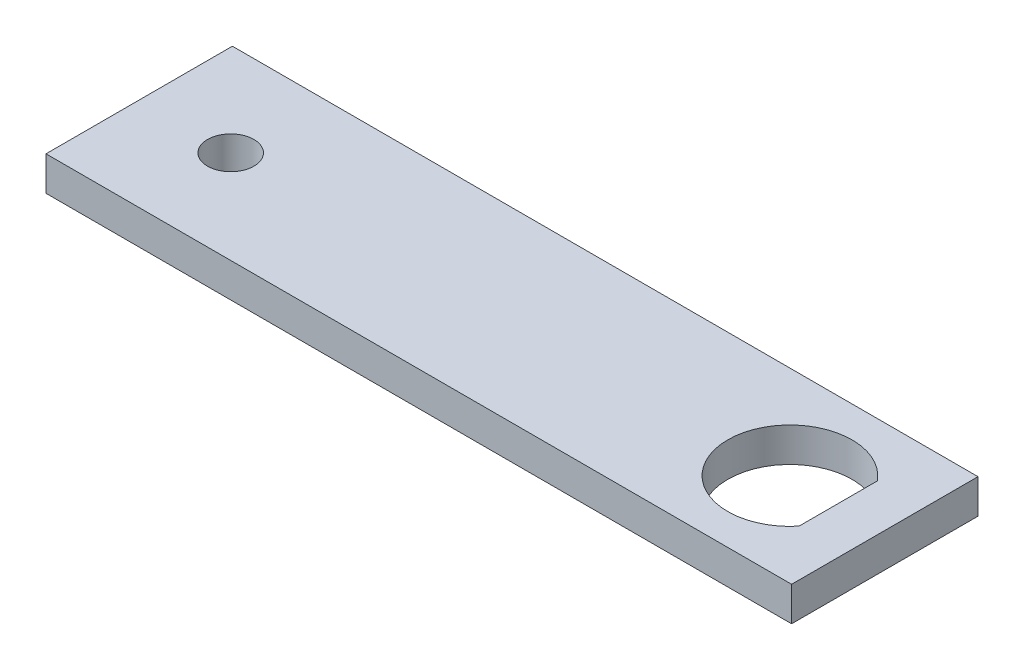
ISO-10303-21;
HEADER;
FILE_DESCRIPTION(('STEP AP214'),'2;1');
FILE_NAME('part.step','',(''),(''),'','','');
FILE_SCHEMA(('AUTOMOTIVE_DESIGN { 1 0 10303 214 1 1 1 1 }'));
ENDSEC;
DATA;
#1=APPLICATION_CONTEXT('core data for automotive mechanical design processes');
#2=APPLICATION_PROTOCOL_DEFINITION('international standard','automotive_design',2000,#1);
#3=PRODUCT_CONTEXT('',#1,'mechanical');
#4=PRODUCT('Part','Part','',(#3));
#5=PRODUCT_RELATED_PRODUCT_CATEGORY('part','',(#4));
#6=PRODUCT_DEFINITION_FORMATION('','',#4);
#7=PRODUCT_DEFINITION_CONTEXT('part definition',#1,'design');
#8=PRODUCT_DEFINITION('design','',#6,#7);
#9=PRODUCT_DEFINITION_SHAPE('','',#8);
#10=(LENGTH_UNIT() NAMED_UNIT(*) SI_UNIT(.MILLI.,.METRE.));
#11=(NAMED_UNIT(*) PLANE_ANGLE_UNIT() SI_UNIT($,.RADIAN.));
#12=(NAMED_UNIT(*) SI_UNIT($,.STERADIAN.) SOLID_ANGLE_UNIT());
#13=UNCERTAINTY_MEASURE_WITH_UNIT(LENGTH_MEASURE(1.E-05),#10,'distance_accuracy_value','');
#14=(GEOMETRIC_REPRESENTATION_CONTEXT(3) GLOBAL_UNCERTAINTY_ASSIGNED_CONTEXT((#13)) GLOBAL_UNIT_ASSIGNED_CONTEXT((#10,
#11,#12)) REPRESENTATION_CONTEXT('',''));
#15=CARTESIAN_POINT('',(0.,0.,0.));
#16=DIRECTION('',(0.,0.,1.));
#17=DIRECTION('',(1.,0.,0.));
#18=AXIS2_PLACEMENT_3D('',#15,#16,#17);
#19=CARTESIAN_POINT('',(0.,3.5,0.));
#20=DIRECTION('',(0.,-1.,0.));
#21=DIRECTION('',(0.,0.,-1.));
#22=AXIS2_PLACEMENT_3D('',#19,#20,#21);
#23=PLANE('',#22);
#24=CARTESIAN_POINT('',(9.35,3.5,-9.525));
#25=DIRECTION('',(0.,1.,0.));
#26=DIRECTION('',(0.,0.,1.));
#27=AXIS2_PLACEMENT_3D('',#24,#25,#26);
#28=CIRCLE('',#27,2.37);
#29=CARTESIAN_POINT('',(9.35,3.5,-7.155));
#30=VERTEX_POINT('',#29);
#31=EDGE_CURVE('E101',#30,#30,#28,.T.);
#32=ORIENTED_EDGE('',*,*,#31,.F.);
#33=EDGE_LOOP('',(#32));
#34=FACE_BOUND('',#33,.T.);
#35=DIRECTION('',(0.,0.,1.));
#36=VECTOR('',#35,1.);
#37=CARTESIAN_POINT('',(0.,3.5,0.));
#38=LINE('',#37,#36);
#39=CARTESIAN_POINT('',(0.,3.5,-19.05));
#40=VERTEX_POINT('',#39);
#41=CARTESIAN_POINT('',(0.,3.5,0.));
#42=VERTEX_POINT('',#41);
#43=EDGE_CURVE('E107',#40,#42,#38,.T.);
#44=ORIENTED_EDGE('',*,*,#43,.T.);
#45=DIRECTION('',(1.,0.,0.));
#46=VECTOR('',#45,1.);
#47=CARTESIAN_POINT('',(0.,3.5,0.));
#48=LINE('',#47,#46);
#49=CARTESIAN_POINT('',(76.2,3.5,0.));
#50=VERTEX_POINT('',#49);
#51=EDGE_CURVE('E110',#42,#50,#48,.T.);
#52=ORIENTED_EDGE('',*,*,#51,.T.);
#53=DIRECTION('',(0.,0.,-1.));
#54=VECTOR('',#53,1.);
#55=CARTESIAN_POINT('',(76.2,3.5,0.));
#56=LINE('',#55,#54);
#57=CARTESIAN_POINT('',(76.2,3.5,-19.05));
#58=VERTEX_POINT('',#57);
#59=EDGE_CURVE('E113',#50,#58,#56,.T.);
#60=ORIENTED_EDGE('',*,*,#59,.T.);
#61=DIRECTION('',(-1.,0.,0.));
#62=VECTOR('',#61,1.);
#63=CARTESIAN_POINT('',(0.,3.5,-19.05));
#64=LINE('',#63,#62);
#65=EDGE_CURVE('E115',#58,#40,#64,.T.);
#66=ORIENTED_EDGE('',*,*,#65,.T.);
#67=EDGE_LOOP('',(#44,#52,#60,#66));
#68=FACE_BOUND('',#67,.T.);
#69=CARTESIAN_POINT('',(66.5,3.5,-9.525));
#70=DIRECTION('',(0.,1.,0.));
#71=DIRECTION('',(0.,0.,1.));
#72=AXIS2_PLACEMENT_3D('',#69,#70,#71);
#73=CIRCLE('',#72,6.35);
#74=CARTESIAN_POINT('',(71.433,3.5,-13.5235010941602));
#75=VERTEX_POINT('',#74);
#76=CARTESIAN_POINT('',(71.433,3.5,-5.52649890583984));
#77=VERTEX_POINT('',#76);
#78=EDGE_CURVE('E90',#75,#77,#73,.T.);
#79=ORIENTED_EDGE('',*,*,#78,.F.);
#80=DIRECTION('',(0.,0.,-1.));
#81=VECTOR('',#80,1.);
#82=CARTESIAN_POINT('',(71.433,3.5,-13.5235010941602));
#83=LINE('',#82,#81);
#84=EDGE_CURVE('E84',#77,#75,#83,.T.);
#85=ORIENTED_EDGE('',*,*,#84,.F.);
#86=EDGE_LOOP('',(#79,#85));
#87=FACE_BOUND('',#86,.T.);
#88=ADVANCED_FACE('F32',(#34,#68,#87),#23,.F.);
#89=CARTESIAN_POINT('',(0.,0.,0.));
#90=DIRECTION('',(0.,-1.,0.));
#91=DIRECTION('',(0.,0.,-1.));
#92=AXIS2_PLACEMENT_3D('',#89,#90,#91);
#93=PLANE('',#92);
#94=DIRECTION('',(0.,0.,1.));
#95=VECTOR('',#94,1.);
#96=CARTESIAN_POINT('',(0.,0.,0.));
#97=LINE('',#96,#95);
#98=CARTESIAN_POINT('',(0.,0.,-19.05));
#99=VERTEX_POINT('',#98);
#100=CARTESIAN_POINT('',(0.,0.,0.));
#101=VERTEX_POINT('',#100);
#102=EDGE_CURVE('E104',#99,#101,#97,.T.);
#103=ORIENTED_EDGE('',*,*,#102,.F.);
#104=DIRECTION('',(-1.,0.,0.));
#105=VECTOR('',#104,1.);
#106=CARTESIAN_POINT('',(0.,0.,-19.05));
#107=LINE('',#106,#105);
#108=CARTESIAN_POINT('',(76.2,0.,-19.05));
#109=VERTEX_POINT('',#108);
#110=EDGE_CURVE('E111',#109,#99,#107,.T.);
#111=ORIENTED_EDGE('',*,*,#110,.F.);
#112=DIRECTION('',(0.,0.,-1.));
#113=VECTOR('',#112,1.);
#114=CARTESIAN_POINT('',(76.2,0.,0.));
#115=LINE('',#114,#113);
#116=CARTESIAN_POINT('',(76.2,0.,0.));
#117=VERTEX_POINT('',#116);
#118=EDGE_CURVE('E122',#117,#109,#115,.T.);
#119=ORIENTED_EDGE('',*,*,#118,.F.);
#120=DIRECTION('',(1.,0.,0.));
#121=VECTOR('',#120,1.);
#122=CARTESIAN_POINT('',(0.,0.,0.));
#123=LINE('',#122,#121);
#124=EDGE_CURVE('E120',#101,#117,#123,.T.);
#125=ORIENTED_EDGE('',*,*,#124,.F.);
#126=EDGE_LOOP('',(#103,#111,#119,#125));
#127=FACE_BOUND('',#126,.T.);
#128=CARTESIAN_POINT('',(9.35,0.,-9.525));
#129=DIRECTION('',(0.,1.,0.));
#130=DIRECTION('',(0.,0.,1.));
#131=AXIS2_PLACEMENT_3D('',#128,#129,#130);
#132=CIRCLE('',#131,2.37);
#133=CARTESIAN_POINT('',(9.35,0.,-7.155));
#134=VERTEX_POINT('',#133);
#135=EDGE_CURVE('E100',#134,#134,#132,.T.);
#136=ORIENTED_EDGE('',*,*,#135,.T.);
#137=EDGE_LOOP('',(#136));
#138=FACE_BOUND('',#137,.T.);
#139=DIRECTION('',(0.,0.,-1.));
#140=VECTOR('',#139,1.);
#141=CARTESIAN_POINT('',(71.433,0.,-13.5235010941602));
#142=LINE('',#141,#140);
#143=CARTESIAN_POINT('',(71.433,0.,-5.52649890583984));
#144=VERTEX_POINT('',#143);
#145=CARTESIAN_POINT('',(71.433,0.,-13.5235010941602));
#146=VERTEX_POINT('',#145);
#147=EDGE_CURVE('E94',#144,#146,#142,.T.);
#148=ORIENTED_EDGE('',*,*,#147,.T.);
#149=CARTESIAN_POINT('',(66.5,0.,-9.525));
#150=DIRECTION('',(0.,1.,0.));
#151=DIRECTION('',(0.,0.,1.));
#152=AXIS2_PLACEMENT_3D('',#149,#150,#151);
#153=CIRCLE('',#152,6.35);
#154=EDGE_CURVE('E54',#146,#144,#153,.T.);
#155=ORIENTED_EDGE('',*,*,#154,.T.);
#156=EDGE_LOOP('',(#148,#155));
#157=FACE_BOUND('',#156,.T.);
#158=ADVANCED_FACE('F140',(#127,#138,#157),#93,.T.);
#159=CARTESIAN_POINT('',(0.,3.5,0.));
#160=DIRECTION('',(1.,0.,0.));
#161=DIRECTION('',(0.,0.,-1.));
#162=AXIS2_PLACEMENT_3D('',#159,#160,#161);
#163=PLANE('',#162);
#164=ORIENTED_EDGE('',*,*,#102,.T.);
#165=DIRECTION('',(0.,-1.,0.));
#166=VECTOR('',#165,1.);
#167=CARTESIAN_POINT('',(0.,3.5,0.));
#168=LINE('',#167,#166);
#169=EDGE_CURVE('E11',#42,#101,#168,.T.);
#170=ORIENTED_EDGE('',*,*,#169,.F.);
#171=ORIENTED_EDGE('',*,*,#43,.F.);
#172=DIRECTION('',(0.,-1.,0.));
#173=VECTOR('',#172,1.);
#174=CARTESIAN_POINT('',(0.,3.5,-19.05));
#175=LINE('',#174,#173);
#176=EDGE_CURVE('E117',#40,#99,#175,.T.);
#177=ORIENTED_EDGE('',*,*,#176,.T.);
#178=EDGE_LOOP('',(#164,#170,#171,#177));
#179=FACE_BOUND('',#178,.T.);
#180=ADVANCED_FACE('F34',(#179),#163,.F.);
#181=CARTESIAN_POINT('',(0.,3.5,0.));
#182=DIRECTION('',(0.,0.,-1.));
#183=DIRECTION('',(-1.,0.,0.));
#184=AXIS2_PLACEMENT_3D('',#181,#182,#183);
#185=PLANE('',#184);
#186=ORIENTED_EDGE('',*,*,#124,.T.);
#187=DIRECTION('',(0.,-1.,0.));
#188=VECTOR('',#187,1.);
#189=CARTESIAN_POINT('',(76.2,3.5,0.));
#190=LINE('',#189,#188);
#191=EDGE_CURVE('E40',#50,#117,#190,.T.);
#192=ORIENTED_EDGE('',*,*,#191,.F.);
#193=ORIENTED_EDGE('',*,*,#51,.F.);
#194=ORIENTED_EDGE('',*,*,#169,.T.);
#195=EDGE_LOOP('',(#186,#192,#193,#194));
#196=FACE_BOUND('',#195,.T.);
#197=ADVANCED_FACE('F150',(#196),#185,.F.);
#198=CARTESIAN_POINT('',(76.2,3.5,0.));
#199=DIRECTION('',(-1.,0.,0.));
#200=DIRECTION('',(0.,0.,1.));
#201=AXIS2_PLACEMENT_3D('',#198,#199,#200);
#202=PLANE('',#201);
#203=ORIENTED_EDGE('',*,*,#118,.T.);
#204=DIRECTION('',(0.,-1.,0.));
#205=VECTOR('',#204,1.);
#206=CARTESIAN_POINT('',(76.2,3.5,-19.05));
#207=LINE('',#206,#205);
#208=EDGE_CURVE('E127',#58,#109,#207,.T.);
#209=ORIENTED_EDGE('',*,*,#208,.F.);
#210=ORIENTED_EDGE('',*,*,#59,.F.);
#211=ORIENTED_EDGE('',*,*,#191,.T.);
#212=EDGE_LOOP('',(#203,#209,#210,#211));
#213=FACE_BOUND('',#212,.T.);
#214=ADVANCED_FACE('F134',(#213),#202,.F.);
#215=CARTESIAN_POINT('',(0.,3.5,-19.05));
#216=DIRECTION('',(0.,0.,1.));
#217=DIRECTION('',(1.,0.,0.));
#218=AXIS2_PLACEMENT_3D('',#215,#216,#217);
#219=PLANE('',#218);
#220=ORIENTED_EDGE('',*,*,#110,.T.);
#221=ORIENTED_EDGE('',*,*,#176,.F.);
#222=ORIENTED_EDGE('',*,*,#65,.F.);
#223=ORIENTED_EDGE('',*,*,#208,.T.);
#224=EDGE_LOOP('',(#220,#221,#222,#223));
#225=FACE_BOUND('',#224,.T.);
#226=ADVANCED_FACE('F144',(#225),#219,.F.);
#227=CARTESIAN_POINT('',(9.35,3.5,-9.525));
#228=DIRECTION('',(0.,-1.,0.));
#229=DIRECTION('',(0.,0.,-1.));
#230=AXIS2_PLACEMENT_3D('',#227,#228,#229);
#231=CYLINDRICAL_SURFACE('',#230,2.37);
#232=ORIENTED_EDGE('',*,*,#31,.T.);
#233=EDGE_LOOP('',(#232));
#234=FACE_BOUND('',#233,.T.);
#235=ORIENTED_EDGE('',*,*,#135,.F.);
#236=EDGE_LOOP('',(#235));
#237=FACE_BOUND('',#236,.T.);
#238=ADVANCED_FACE('F166',(#234,#237),#231,.F.);
#239=CARTESIAN_POINT('',(66.5,3.5,-9.525));
#240=DIRECTION('',(0.,-1.,0.));
#241=DIRECTION('',(0.,0.,-1.));
#242=AXIS2_PLACEMENT_3D('',#239,#240,#241);
#243=CYLINDRICAL_SURFACE('',#242,6.35);
#244=ORIENTED_EDGE('',*,*,#154,.F.);
#245=DIRECTION('',(0.,-1.,0.));
#246=VECTOR('',#245,1.);
#247=CARTESIAN_POINT('',(71.433,3.5,-13.5235010941602));
#248=LINE('',#247,#246);
#249=EDGE_CURVE('E86',#75,#146,#248,.T.);
#250=ORIENTED_EDGE('',*,*,#249,.F.);
#251=ORIENTED_EDGE('',*,*,#78,.T.);
#252=DIRECTION('',(0.,-1.,0.));
#253=VECTOR('',#252,1.);
#254=CARTESIAN_POINT('',(71.433,3.5,-5.52649890583984));
#255=LINE('',#254,#253);
#256=EDGE_CURVE('E47',#77,#144,#255,.T.);
#257=ORIENTED_EDGE('',*,*,#256,.T.);
#258=EDGE_LOOP('',(#244,#250,#251,#257));
#259=FACE_BOUND('',#258,.T.);
#260=ADVANCED_FACE('F92',(#259),#243,.F.);
#261=CARTESIAN_POINT('',(71.433,3.5,-13.5235010941602));
#262=DIRECTION('',(-1.,0.,0.));
#263=DIRECTION('',(0.,0.,1.));
#264=AXIS2_PLACEMENT_3D('',#261,#262,#263);
#265=PLANE('',#264);
#266=ORIENTED_EDGE('',*,*,#147,.F.);
#267=ORIENTED_EDGE('',*,*,#256,.F.);
#268=ORIENTED_EDGE('',*,*,#84,.T.);
#269=ORIENTED_EDGE('',*,*,#249,.T.);
#270=EDGE_LOOP('',(#266,#267,#268,#269));
#271=FACE_BOUND('',#270,.T.);
#272=ADVANCED_FACE('F85',(#271),#265,.T.);
#273=CLOSED_SHELL('',(#88,#158,#180,#197,#214,#226,#238,#260,#272));
#274=MANIFOLD_SOLID_BREP('B2',#273);
#275=ADVANCED_BREP_SHAPE_REPRESENTATION('',(#18,#274),#14);
#276=SHAPE_DEFINITION_REPRESENTATION(#9,#275);
ENDSEC;
END-ISO-10303-21;
